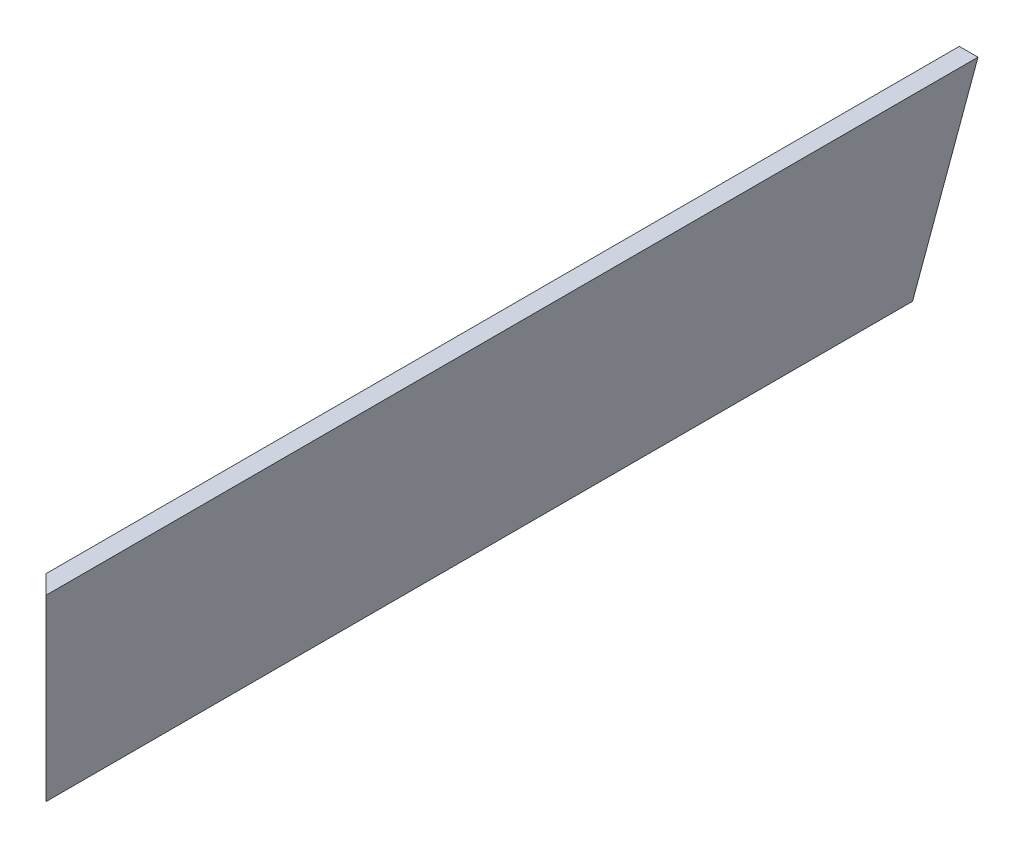
ISO-10303-21;
HEADER;
FILE_DESCRIPTION(('STEP AP214'),'2;1');
FILE_NAME('part.step','',(''),(''),'','','');
FILE_SCHEMA(('AUTOMOTIVE_DESIGN { 1 0 10303 214 1 1 1 1 }'));
ENDSEC;
DATA;
#1=APPLICATION_CONTEXT('core data for automotive mechanical design processes');
#2=APPLICATION_PROTOCOL_DEFINITION('international standard','automotive_design',2000,#1);
#3=PRODUCT_CONTEXT('',#1,'mechanical');
#4=PRODUCT('Part','Part','',(#3));
#5=PRODUCT_RELATED_PRODUCT_CATEGORY('part','',(#4));
#6=PRODUCT_DEFINITION_FORMATION('','',#4);
#7=PRODUCT_DEFINITION_CONTEXT('part definition',#1,'design');
#8=PRODUCT_DEFINITION('design','',#6,#7);
#9=PRODUCT_DEFINITION_SHAPE('','',#8);
#10=(LENGTH_UNIT() NAMED_UNIT(*) SI_UNIT(.MILLI.,.METRE.));
#11=(NAMED_UNIT(*) PLANE_ANGLE_UNIT() SI_UNIT($,.RADIAN.));
#12=(NAMED_UNIT(*) SI_UNIT($,.STERADIAN.) SOLID_ANGLE_UNIT());
#13=UNCERTAINTY_MEASURE_WITH_UNIT(LENGTH_MEASURE(1.E-05),#10,'distance_accuracy_value','');
#14=(GEOMETRIC_REPRESENTATION_CONTEXT(3) GLOBAL_UNCERTAINTY_ASSIGNED_CONTEXT((#13)) GLOBAL_UNIT_ASSIGNED_CONTEXT((#10,
#11,#12)) REPRESENTATION_CONTEXT('',''));
#15=CARTESIAN_POINT('',(0.,0.,0.));
#16=DIRECTION('',(0.,0.,1.));
#17=DIRECTION('',(1.,0.,0.));
#18=AXIS2_PLACEMENT_3D('',#15,#16,#17);
#19=CARTESIAN_POINT('',(642.470018728019,171.741611914197,845.302893715292));
#20=DIRECTION('',(0.96592582628907,-0.258819045102515,0.));
#21=DIRECTION('',(0.258819045102515,0.96592582628907,0.));
#22=AXIS2_PLACEMENT_3D('',#19,#20,#21);
#23=PLANE('',#22);
#24=DIRECTION('',(-0.250562807085726,-0.935113126531032,-0.250562807085726));
#25=VECTOR('',#24,1.);
#26=CARTESIAN_POINT('',(655.204215552036,219.26628145501,655.204215552035));
#27=LINE('',#26,#25);
#28=CARTESIAN_POINT('',(642.470018728019,171.741611914197,642.470018728019));
#29=VERTEX_POINT('',#28);
#30=CARTESIAN_POINT('',(596.451992508792,0.,596.451992508792));
#31=VERTEX_POINT('',#30);
#32=EDGE_CURVE('E90',#29,#31,#27,.T.);
#33=ORIENTED_EDGE('',*,*,#32,.F.);
#34=DIRECTION('',(0.,0.,-1.));
#35=VECTOR('',#34,1.);
#36=CARTESIAN_POINT('',(642.470018728019,171.741611914197,845.302893715292));
#37=LINE('',#36,#35);
#38=CARTESIAN_POINT('',(642.470018728019,171.741611914197,0.));
#39=VERTEX_POINT('',#38);
#40=EDGE_CURVE('E43',#29,#39,#37,.T.);
#41=ORIENTED_EDGE('',*,*,#40,.T.);
#42=DIRECTION('',(-0.258819045102515,-0.96592582628907,0.));
#43=VECTOR('',#42,1.);
#44=CARTESIAN_POINT('',(642.470018728019,171.741611914197,0.));
#45=LINE('',#44,#43);
#46=CARTESIAN_POINT('',(596.451992508792,0.,0.));
#47=VERTEX_POINT('',#46);
#48=EDGE_CURVE('E88',#39,#47,#45,.T.);
#49=ORIENTED_EDGE('',*,*,#48,.T.);
#50=DIRECTION('',(0.,0.,-1.));
#51=VECTOR('',#50,1.);
#52=CARTESIAN_POINT('',(596.451992508792,0.,845.302893715292));
#53=LINE('',#52,#51);
#54=EDGE_CURVE('E79',#31,#47,#53,.T.);
#55=ORIENTED_EDGE('',*,*,#54,.F.);
#56=EDGE_LOOP('',(#33,#41,#49,#55));
#57=FACE_BOUND('',#56,.T.);
#58=ADVANCED_FACE('F39',(#57),#23,.F.);
#59=CARTESIAN_POINT('',(596.451992508792,0.,845.302893715292));
#60=DIRECTION('',(0.,1.,0.));
#61=DIRECTION('',(0.,0.,1.));
#62=AXIS2_PLACEMENT_3D('',#59,#60,#61);
#63=PLANE('',#62);
#64=DIRECTION('',(0.707106781186548,0.,0.707106781186547));
#65=VECTOR('',#64,1.);
#66=CARTESIAN_POINT('',(720.877443112042,0.,720.877443112042));
#67=LINE('',#66,#65);
#68=CARTESIAN_POINT('',(609.6,0.,609.6));
#69=VERTEX_POINT('',#68);
#70=EDGE_CURVE('E49',#31,#69,#67,.T.);
#71=ORIENTED_EDGE('',*,*,#70,.F.);
#72=ORIENTED_EDGE('',*,*,#54,.T.);
#73=DIRECTION('',(1.,0.,0.));
#74=VECTOR('',#73,1.);
#75=CARTESIAN_POINT('',(596.451992508792,0.,0.));
#76=LINE('',#75,#74);
#77=CARTESIAN_POINT('',(609.6,0.,0.));
#78=VERTEX_POINT('',#77);
#79=EDGE_CURVE('E102',#47,#78,#76,.T.);
#80=ORIENTED_EDGE('',*,*,#79,.T.);
#81=DIRECTION('',(0.,0.,-1.));
#82=VECTOR('',#81,1.);
#83=CARTESIAN_POINT('',(609.6,0.,845.302893715292));
#84=LINE('',#83,#82);
#85=EDGE_CURVE('E116',#69,#78,#84,.T.);
#86=ORIENTED_EDGE('',*,*,#85,.F.);
#87=EDGE_LOOP('',(#71,#72,#80,#86));
#88=FACE_BOUND('',#87,.T.);
#89=ADVANCED_FACE('F123',(#88),#63,.F.);
#90=CARTESIAN_POINT('',(609.6,0.,845.302893715292));
#91=DIRECTION('',(-0.96592582628907,0.258819045102515,0.));
#92=DIRECTION('',(-0.258819045102515,-0.96592582628907,0.));
#93=AXIS2_PLACEMENT_3D('',#90,#91,#92);
#94=PLANE('',#93);
#95=DIRECTION('',(0.250562807085726,0.935113126531032,0.250562807085726));
#96=VECTOR('',#95,1.);
#97=CARTESIAN_POINT('',(624.39783314588,55.2262651423518,624.39783314588));
#98=LINE('',#97,#96);
#99=CARTESIAN_POINT('',(655.618026219227,171.741611914197,655.618026219227));
#100=VERTEX_POINT('',#99);
#101=EDGE_CURVE('E11',#69,#100,#98,.T.);
#102=ORIENTED_EDGE('',*,*,#101,.F.);
#103=ORIENTED_EDGE('',*,*,#85,.T.);
#104=DIRECTION('',(0.258819045102515,0.96592582628907,0.));
#105=VECTOR('',#104,1.);
#106=CARTESIAN_POINT('',(609.6,0.,0.));
#107=LINE('',#106,#105);
#108=CARTESIAN_POINT('',(655.618026219227,171.741611914197,0.));
#109=VERTEX_POINT('',#108);
#110=EDGE_CURVE('E118',#78,#109,#107,.T.);
#111=ORIENTED_EDGE('',*,*,#110,.T.);
#112=DIRECTION('',(0.,0.,-1.));
#113=VECTOR('',#112,1.);
#114=CARTESIAN_POINT('',(655.618026219227,171.741611914197,845.302893715292));
#115=LINE('',#114,#113);
#116=EDGE_CURVE('E62',#100,#109,#115,.T.);
#117=ORIENTED_EDGE('',*,*,#116,.F.);
#118=EDGE_LOOP('',(#102,#103,#111,#117));
#119=FACE_BOUND('',#118,.T.);
#120=ADVANCED_FACE('F122',(#119),#94,.F.);
#121=CARTESIAN_POINT('',(655.618026219227,171.741611914197,845.302893715292));
#122=DIRECTION('',(0.,-1.,0.));
#123=DIRECTION('',(0.,0.,-1.));
#124=AXIS2_PLACEMENT_3D('',#121,#122,#123);
#125=PLANE('',#124);
#126=DIRECTION('',(-0.707106781186548,0.,-0.707106781186547));
#127=VECTOR('',#126,1.);
#128=CARTESIAN_POINT('',(750.46045996726,171.741611914197,750.460459967259));
#129=LINE('',#128,#127);
#130=EDGE_CURVE('E99',#100,#29,#129,.T.);
#131=ORIENTED_EDGE('',*,*,#130,.F.);
#132=ORIENTED_EDGE('',*,*,#116,.T.);
#133=DIRECTION('',(-1.,0.,0.));
#134=VECTOR('',#133,1.);
#135=CARTESIAN_POINT('',(655.618026219227,171.741611914197,0.));
#136=LINE('',#135,#134);
#137=EDGE_CURVE('E94',#109,#39,#136,.T.);
#138=ORIENTED_EDGE('',*,*,#137,.T.);
#139=ORIENTED_EDGE('',*,*,#40,.F.);
#140=EDGE_LOOP('',(#131,#132,#138,#139));
#141=FACE_BOUND('',#140,.T.);
#142=ADVANCED_FACE('F95',(#141),#125,.F.);
#143=CARTESIAN_POINT('',(0.,0.,0.));
#144=DIRECTION('',(0.,0.,1.));
#145=DIRECTION('',(1.,0.,0.));
#146=AXIS2_PLACEMENT_3D('',#143,#144,#145);
#147=PLANE('',#146);
#148=ORIENTED_EDGE('',*,*,#48,.F.);
#149=ORIENTED_EDGE('',*,*,#137,.F.);
#150=ORIENTED_EDGE('',*,*,#110,.F.);
#151=ORIENTED_EDGE('',*,*,#79,.F.);
#152=EDGE_LOOP('',(#148,#149,#150,#151));
#153=FACE_BOUND('',#152,.T.);
#154=ADVANCED_FACE('F101',(#153),#147,.F.);
#155=CARTESIAN_POINT('',(0.,0.,0.));
#156=DIRECTION('',(-0.707106781186547,0.,0.707106781186548));
#157=DIRECTION('',(0.707106781186548,0.,0.707106781186547));
#158=AXIS2_PLACEMENT_3D('',#155,#156,#157);
#159=PLANE('',#158);
#160=ORIENTED_EDGE('',*,*,#130,.T.);
#161=ORIENTED_EDGE('',*,*,#32,.T.);
#162=ORIENTED_EDGE('',*,*,#70,.T.);
#163=ORIENTED_EDGE('',*,*,#101,.T.);
#164=EDGE_LOOP('',(#160,#161,#162,#163));
#165=FACE_BOUND('',#164,.T.);
#166=ADVANCED_FACE('F41',(#165),#159,.T.);
#167=CLOSED_SHELL('',(#58,#89,#120,#142,#154,#166));
#168=MANIFOLD_SOLID_BREP('B2',#167);
#169=ADVANCED_BREP_SHAPE_REPRESENTATION('',(#18,#168),#14);
#170=SHAPE_DEFINITION_REPRESENTATION(#9,#169);
ENDSEC;
END-ISO-10303-21;
